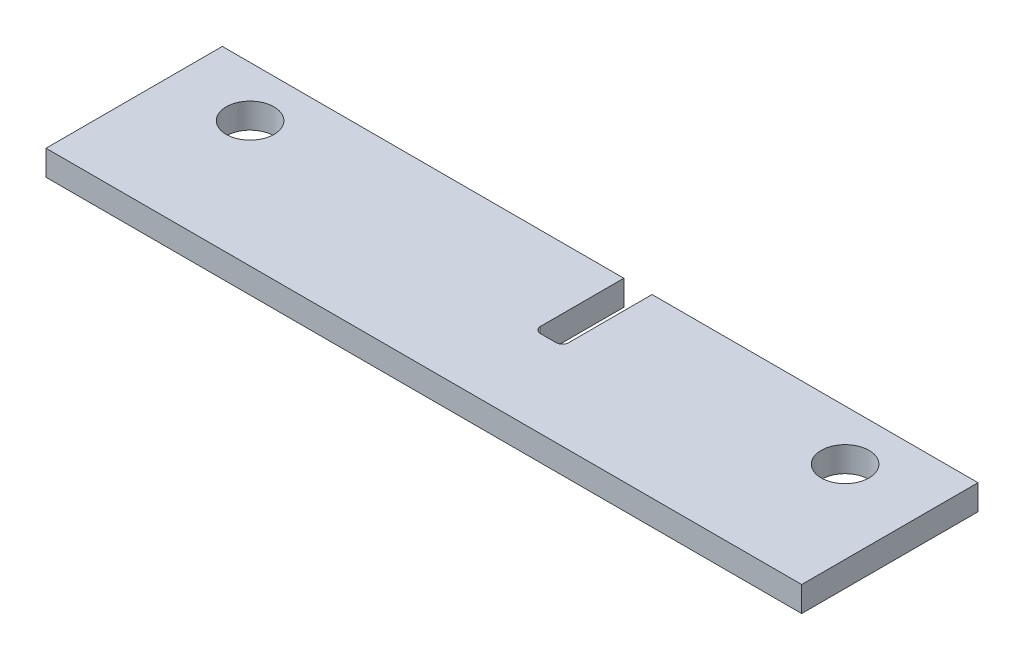
ISO-10303-21;
HEADER;
FILE_DESCRIPTION(('STEP AP214'),'2;1');
FILE_NAME('part.step','',(''),(''),'','','');
FILE_SCHEMA(('AUTOMOTIVE_DESIGN { 1 0 10303 214 1 1 1 1 }'));
ENDSEC;
DATA;
#1=APPLICATION_CONTEXT('core data for automotive mechanical design processes');
#2=APPLICATION_PROTOCOL_DEFINITION('international standard','automotive_design',2000,#1);
#3=PRODUCT_CONTEXT('',#1,'mechanical');
#4=PRODUCT('Part','Part','',(#3));
#5=PRODUCT_RELATED_PRODUCT_CATEGORY('part','',(#4));
#6=PRODUCT_DEFINITION_FORMATION('','',#4);
#7=PRODUCT_DEFINITION_CONTEXT('part definition',#1,'design');
#8=PRODUCT_DEFINITION('design','',#6,#7);
#9=PRODUCT_DEFINITION_SHAPE('','',#8);
#10=(LENGTH_UNIT() NAMED_UNIT(*) SI_UNIT(.MILLI.,.METRE.));
#11=(NAMED_UNIT(*) PLANE_ANGLE_UNIT() SI_UNIT($,.RADIAN.));
#12=(NAMED_UNIT(*) SI_UNIT($,.STERADIAN.) SOLID_ANGLE_UNIT());
#13=UNCERTAINTY_MEASURE_WITH_UNIT(LENGTH_MEASURE(1.E-05),#10,'distance_accuracy_value','');
#14=(GEOMETRIC_REPRESENTATION_CONTEXT(3) GLOBAL_UNCERTAINTY_ASSIGNED_CONTEXT((#13)) GLOBAL_UNIT_ASSIGNED_CONTEXT((#10,
#11,#12)) REPRESENTATION_CONTEXT('',''));
#15=CARTESIAN_POINT('',(0.,0.,0.));
#16=DIRECTION('',(0.,0.,1.));
#17=DIRECTION('',(1.,0.,0.));
#18=AXIS2_PLACEMENT_3D('',#15,#16,#17);
#19=CARTESIAN_POINT('',(0.,0.,249.6));
#20=DIRECTION('',(0.,0.,-1.));
#21=DIRECTION('',(-1.,0.,0.));
#22=AXIS2_PLACEMENT_3D('',#19,#20,#21);
#23=PLANE('',#22);
#24=DIRECTION('',(0.,1.,0.));
#25=VECTOR('',#24,1.);
#26=CARTESIAN_POINT('',(2477.262,115.8,249.6));
#27=LINE('',#26,#25);
#28=CARTESIAN_POINT('',(2477.262,115.8,249.6));
#29=VERTEX_POINT('',#28);
#30=CARTESIAN_POINT('',(2477.262,128.5,249.6));
#31=VERTEX_POINT('',#30);
#32=EDGE_CURVE('E148',#29,#31,#27,.T.);
#33=ORIENTED_EDGE('',*,*,#32,.T.);
#34=DIRECTION('',(-1.,0.,0.));
#35=VECTOR('',#34,1.);
#36=CARTESIAN_POINT('',(2260.6,128.5,249.6));
#37=LINE('',#36,#35);
#38=CARTESIAN_POINT('',(2641.6,128.5,249.6));
#39=VERTEX_POINT('',#38);
#40=EDGE_CURVE('E130',#39,#31,#37,.T.);
#41=ORIENTED_EDGE('',*,*,#40,.F.);
#42=DIRECTION('',(0.,1.,0.));
#43=VECTOR('',#42,1.);
#44=CARTESIAN_POINT('',(2641.6,115.8,249.6));
#45=LINE('',#44,#43);
#46=CARTESIAN_POINT('',(2641.6,115.8,249.6));
#47=VERTEX_POINT('',#46);
#48=EDGE_CURVE('E168',#47,#39,#45,.T.);
#49=ORIENTED_EDGE('',*,*,#48,.F.);
#50=DIRECTION('',(1.,0.,0.));
#51=VECTOR('',#50,1.);
#52=CARTESIAN_POINT('',(2260.6,115.8,249.6));
#53=LINE('',#52,#51);
#54=EDGE_CURVE('E186',#29,#47,#53,.T.);
#55=ORIENTED_EDGE('',*,*,#54,.F.);
#56=EDGE_LOOP('',(#33,#41,#49,#55));
#57=FACE_BOUND('',#56,.T.);
#58=ADVANCED_FACE('F43',(#57),#23,.T.);
#59=CARTESIAN_POINT('',(2260.6,115.8,249.6));
#60=DIRECTION('',(-1.,0.,0.));
#61=DIRECTION('',(0.,0.,1.));
#62=AXIS2_PLACEMENT_3D('',#59,#60,#61);
#63=PLANE('',#62);
#64=DIRECTION('',(0.,0.,1.));
#65=VECTOR('',#64,1.);
#66=CARTESIAN_POINT('',(2260.6,115.8,249.6));
#67=LINE('',#66,#65);
#68=CARTESIAN_POINT('',(2260.6,115.8,249.6));
#69=VERTEX_POINT('',#68);
#70=CARTESIAN_POINT('',(2260.6,115.8,338.5));
#71=VERTEX_POINT('',#70);
#72=EDGE_CURVE('E144',#69,#71,#67,.T.);
#73=ORIENTED_EDGE('',*,*,#72,.T.);
#74=DIRECTION('',(0.,-1.,0.));
#75=VECTOR('',#74,1.);
#76=CARTESIAN_POINT('',(2260.6,115.8,338.5));
#77=LINE('',#76,#75);
#78=CARTESIAN_POINT('',(2260.6,128.5,338.5));
#79=VERTEX_POINT('',#78);
#80=EDGE_CURVE('E137',#79,#71,#77,.T.);
#81=ORIENTED_EDGE('',*,*,#80,.F.);
#82=DIRECTION('',(0.,0.,1.));
#83=VECTOR('',#82,1.);
#84=CARTESIAN_POINT('',(2260.6,128.5,249.6));
#85=LINE('',#84,#83);
#86=CARTESIAN_POINT('',(2260.6,128.5,249.6));
#87=VERTEX_POINT('',#86);
#88=EDGE_CURVE('E122',#87,#79,#85,.T.);
#89=ORIENTED_EDGE('',*,*,#88,.F.);
#90=DIRECTION('',(0.,-1.,0.));
#91=VECTOR('',#90,1.);
#92=CARTESIAN_POINT('',(2260.6,115.8,249.6));
#93=LINE('',#92,#91);
#94=EDGE_CURVE('E135',#87,#69,#93,.T.);
#95=ORIENTED_EDGE('',*,*,#94,.T.);
#96=EDGE_LOOP('',(#73,#81,#89,#95));
#97=FACE_BOUND('',#96,.T.);
#98=ADVANCED_FACE('F134',(#97),#63,.T.);
#99=CARTESIAN_POINT('',(2260.6,128.5,249.6));
#100=DIRECTION('',(0.,1.,0.));
#101=DIRECTION('',(0.,0.,1.));
#102=AXIS2_PLACEMENT_3D('',#99,#100,#101);
#103=PLANE('',#102);
#104=CARTESIAN_POINT('',(2599.99999999996,128.5,275.));
#105=DIRECTION('',(0.,1.,0.));
#106=DIRECTION('',(0.,0.,1.));
#107=AXIS2_PLACEMENT_3D('',#104,#105,#106);
#108=CIRCLE('',#107,12.0649999999999);
#109=CARTESIAN_POINT('',(2599.99999999996,128.5,262.935));
#110=VERTEX_POINT('',#109);
#111=EDGE_CURVE('E143',#110,#110,#108,.F.);
#112=ORIENTED_EDGE('',*,*,#111,.T.);
#113=EDGE_LOOP('',(#112));
#114=FACE_BOUND('',#113,.T.);
#115=CARTESIAN_POINT('',(2299.99999999996,128.5,275.));
#116=DIRECTION('',(0.,1.,0.));
#117=DIRECTION('',(0.,0.,1.));
#118=AXIS2_PLACEMENT_3D('',#115,#116,#117);
#119=CIRCLE('',#118,12.0649999999999);
#120=CARTESIAN_POINT('',(2299.99999999996,128.5,262.935));
#121=VERTEX_POINT('',#120);
#122=EDGE_CURVE('E128',#121,#121,#119,.F.);
#123=ORIENTED_EDGE('',*,*,#122,.T.);
#124=EDGE_LOOP('',(#123));
#125=FACE_BOUND('',#124,.T.);
#126=DIRECTION('',(0.,0.,-1.));
#127=VECTOR('',#126,1.);
#128=CARTESIAN_POINT('',(2477.262,128.5,249.6));
#129=LINE('',#128,#127);
#130=CARTESIAN_POINT('',(2477.262,128.5,291.637));
#131=VERTEX_POINT('',#130);
#132=EDGE_CURVE('E155',#131,#31,#129,.T.);
#133=ORIENTED_EDGE('',*,*,#132,.F.);
#134=CARTESIAN_POINT('',(2474.087,128.5,291.637));
#135=DIRECTION('',(0.,1.,0.));
#136=DIRECTION('',(0.,0.,1.));
#137=AXIS2_PLACEMENT_3D('',#134,#135,#136);
#138=CIRCLE('',#137,3.175);
#139=CARTESIAN_POINT('',(2474.087,128.5,294.812));
#140=VERTEX_POINT('',#139);
#141=EDGE_CURVE('E198',#131,#140,#138,.F.);
#142=ORIENTED_EDGE('',*,*,#141,.T.);
#143=DIRECTION('',(1.,0.,0.));
#144=VECTOR('',#143,1.);
#145=CARTESIAN_POINT('',(2260.6,128.5,294.812000000001));
#146=LINE('',#145,#144);
#147=CARTESIAN_POINT('',(2466.213,128.5,294.812));
#148=VERTEX_POINT('',#147);
#149=EDGE_CURVE('E174',#148,#140,#146,.T.);
#150=ORIENTED_EDGE('',*,*,#149,.F.);
#151=CARTESIAN_POINT('',(2466.213,128.5,291.637));
#152=DIRECTION('',(0.,1.,0.));
#153=DIRECTION('',(0.,0.,1.));
#154=AXIS2_PLACEMENT_3D('',#151,#152,#153);
#155=CIRCLE('',#154,3.175);
#156=CARTESIAN_POINT('',(2463.038,128.5,291.637));
#157=VERTEX_POINT('',#156);
#158=EDGE_CURVE('E51',#148,#157,#155,.F.);
#159=ORIENTED_EDGE('',*,*,#158,.T.);
#160=DIRECTION('',(0.,0.,1.));
#161=VECTOR('',#160,1.);
#162=CARTESIAN_POINT('',(2463.038,128.5,249.6));
#163=LINE('',#162,#161);
#164=CARTESIAN_POINT('',(2463.038,128.5,249.6));
#165=VERTEX_POINT('',#164);
#166=EDGE_CURVE('E124',#165,#157,#163,.T.);
#167=ORIENTED_EDGE('',*,*,#166,.F.);
#168=EDGE_CURVE('E117',#165,#87,#37,.T.);
#169=ORIENTED_EDGE('',*,*,#168,.T.);
#170=ORIENTED_EDGE('',*,*,#88,.T.);
#171=DIRECTION('',(-1.,0.,0.));
#172=VECTOR('',#171,1.);
#173=CARTESIAN_POINT('',(2260.6,128.5,338.5));
#174=LINE('',#173,#172);
#175=CARTESIAN_POINT('',(2641.6,128.5,338.5));
#176=VERTEX_POINT('',#175);
#177=EDGE_CURVE('E153',#176,#79,#174,.T.);
#178=ORIENTED_EDGE('',*,*,#177,.F.);
#179=DIRECTION('',(0.,0.,1.));
#180=VECTOR('',#179,1.);
#181=CARTESIAN_POINT('',(2641.6,128.5,249.6));
#182=LINE('',#181,#180);
#183=EDGE_CURVE('E379',#39,#176,#182,.T.);
#184=ORIENTED_EDGE('',*,*,#183,.F.);
#185=ORIENTED_EDGE('',*,*,#40,.T.);
#186=EDGE_LOOP('',(#133,#142,#150,#159,#167,#169,#170,#178,#184,#185));
#187=FACE_BOUND('',#186,.T.);
#188=ADVANCED_FACE('F120',(#114,#125,#187),#103,.T.);
#189=CARTESIAN_POINT('',(2641.6,115.8,249.6));
#190=DIRECTION('',(1.,0.,0.));
#191=DIRECTION('',(0.,0.,-1.));
#192=AXIS2_PLACEMENT_3D('',#189,#190,#191);
#193=PLANE('',#192);
#194=ORIENTED_EDGE('',*,*,#183,.T.);
#195=DIRECTION('',(0.,1.,0.));
#196=VECTOR('',#195,1.);
#197=CARTESIAN_POINT('',(2641.6,115.8,338.5));
#198=LINE('',#197,#196);
#199=CARTESIAN_POINT('',(2641.6,115.8,338.5));
#200=VERTEX_POINT('',#199);
#201=EDGE_CURVE('E156',#200,#176,#198,.T.);
#202=ORIENTED_EDGE('',*,*,#201,.F.);
#203=DIRECTION('',(0.,0.,1.));
#204=VECTOR('',#203,1.);
#205=CARTESIAN_POINT('',(2641.6,115.8,249.6));
#206=LINE('',#205,#204);
#207=EDGE_CURVE('E385',#47,#200,#206,.T.);
#208=ORIENTED_EDGE('',*,*,#207,.F.);
#209=ORIENTED_EDGE('',*,*,#48,.T.);
#210=EDGE_LOOP('',(#194,#202,#208,#209));
#211=FACE_BOUND('',#210,.T.);
#212=ADVANCED_FACE('F249',(#211),#193,.T.);
#213=CARTESIAN_POINT('',(2260.6,115.8,249.6));
#214=DIRECTION('',(0.,-1.,0.));
#215=DIRECTION('',(0.,0.,-1.));
#216=AXIS2_PLACEMENT_3D('',#213,#214,#215);
#217=PLANE('',#216);
#218=CARTESIAN_POINT('',(2599.99999999996,115.8,275.));
#219=DIRECTION('',(0.,-1.,0.));
#220=DIRECTION('',(0.,0.,-1.));
#221=AXIS2_PLACEMENT_3D('',#218,#219,#220);
#222=CIRCLE('',#221,12.0649999999999);
#223=CARTESIAN_POINT('',(2599.99999999996,115.8,262.935));
#224=VERTEX_POINT('',#223);
#225=EDGE_CURVE('E164',#224,#224,#222,.F.);
#226=ORIENTED_EDGE('',*,*,#225,.T.);
#227=EDGE_LOOP('',(#226));
#228=FACE_BOUND('',#227,.T.);
#229=CARTESIAN_POINT('',(2299.99999999996,115.8,275.));
#230=DIRECTION('',(0.,-1.,0.));
#231=DIRECTION('',(0.,0.,-1.));
#232=AXIS2_PLACEMENT_3D('',#229,#230,#231);
#233=CIRCLE('',#232,12.0649999999999);
#234=CARTESIAN_POINT('',(2299.99999999996,115.8,262.935));
#235=VERTEX_POINT('',#234);
#236=EDGE_CURVE('E167',#235,#235,#233,.F.);
#237=ORIENTED_EDGE('',*,*,#236,.T.);
#238=EDGE_LOOP('',(#237));
#239=FACE_BOUND('',#238,.T.);
#240=DIRECTION('',(1.,0.,0.));
#241=VECTOR('',#240,1.);
#242=CARTESIAN_POINT('',(2476.5,115.8,294.812));
#243=LINE('',#242,#241);
#244=CARTESIAN_POINT('',(2466.213,115.8,294.812));
#245=VERTEX_POINT('',#244);
#246=CARTESIAN_POINT('',(2474.087,115.8,294.812));
#247=VERTEX_POINT('',#246);
#248=EDGE_CURVE('E162',#245,#247,#243,.T.);
#249=ORIENTED_EDGE('',*,*,#248,.T.);
#250=CARTESIAN_POINT('',(2474.087,115.8,291.637));
#251=DIRECTION('',(0.,-1.,0.));
#252=DIRECTION('',(0.,0.,-1.));
#253=AXIS2_PLACEMENT_3D('',#250,#251,#252);
#254=CIRCLE('',#253,3.175);
#255=CARTESIAN_POINT('',(2477.262,115.8,291.637));
#256=VERTEX_POINT('',#255);
#257=EDGE_CURVE('E200',#247,#256,#254,.F.);
#258=ORIENTED_EDGE('',*,*,#257,.T.);
#259=DIRECTION('',(0.,0.,-1.));
#260=VECTOR('',#259,1.);
#261=CARTESIAN_POINT('',(2477.262,115.8,249.6));
#262=LINE('',#261,#260);
#263=EDGE_CURVE('E173',#256,#29,#262,.T.);
#264=ORIENTED_EDGE('',*,*,#263,.T.);
#265=ORIENTED_EDGE('',*,*,#54,.T.);
#266=ORIENTED_EDGE('',*,*,#207,.T.);
#267=DIRECTION('',(1.,0.,0.));
#268=VECTOR('',#267,1.);
#269=CARTESIAN_POINT('',(2260.6,115.8,338.5));
#270=LINE('',#269,#268);
#271=EDGE_CURVE('E159',#71,#200,#270,.T.);
#272=ORIENTED_EDGE('',*,*,#271,.F.);
#273=ORIENTED_EDGE('',*,*,#72,.F.);
#274=CARTESIAN_POINT('',(2463.038,115.8,249.6));
#275=VERTEX_POINT('',#274);
#276=EDGE_CURVE('E142',#69,#275,#53,.T.);
#277=ORIENTED_EDGE('',*,*,#276,.T.);
#278=DIRECTION('',(0.,0.,1.));
#279=VECTOR('',#278,1.);
#280=CARTESIAN_POINT('',(2463.038,115.8,294.05));
#281=LINE('',#280,#279);
#282=CARTESIAN_POINT('',(2463.038,115.8,291.637));
#283=VERTEX_POINT('',#282);
#284=EDGE_CURVE('E181',#275,#283,#281,.T.);
#285=ORIENTED_EDGE('',*,*,#284,.T.);
#286=CARTESIAN_POINT('',(2466.213,115.8,291.637));
#287=DIRECTION('',(0.,-1.,0.));
#288=DIRECTION('',(0.,0.,-1.));
#289=AXIS2_PLACEMENT_3D('',#286,#287,#288);
#290=CIRCLE('',#289,3.175);
#291=EDGE_CURVE('E12',#283,#245,#290,.F.);
#292=ORIENTED_EDGE('',*,*,#291,.T.);
#293=EDGE_LOOP('',(#249,#258,#264,#265,#266,#272,#273,#277,#285,#292));
#294=FACE_BOUND('',#293,.T.);
#295=ADVANCED_FACE('F204',(#228,#239,#294),#217,.T.);
#296=DIRECTION('',(0.,1.,0.));
#297=VECTOR('',#296,1.);
#298=CARTESIAN_POINT('',(2463.038,0.,249.6));
#299=LINE('',#298,#297);
#300=EDGE_CURVE('E178',#275,#165,#299,.T.);
#301=ORIENTED_EDGE('',*,*,#300,.F.);
#302=ORIENTED_EDGE('',*,*,#276,.F.);
#303=ORIENTED_EDGE('',*,*,#94,.F.);
#304=ORIENTED_EDGE('',*,*,#168,.F.);
#305=EDGE_LOOP('',(#301,#302,#303,#304));
#306=FACE_BOUND('',#305,.T.);
#307=ADVANCED_FACE('F140',(#306),#23,.T.);
#308=CARTESIAN_POINT('',(0.,0.,338.5));
#309=DIRECTION('',(0.,0.,-1.));
#310=DIRECTION('',(-1.,0.,0.));
#311=AXIS2_PLACEMENT_3D('',#308,#309,#310);
#312=PLANE('',#311);
#313=ORIENTED_EDGE('',*,*,#80,.T.);
#314=ORIENTED_EDGE('',*,*,#271,.T.);
#315=ORIENTED_EDGE('',*,*,#201,.T.);
#316=ORIENTED_EDGE('',*,*,#177,.T.);
#317=EDGE_LOOP('',(#313,#314,#315,#316));
#318=FACE_BOUND('',#317,.T.);
#319=ADVANCED_FACE('F243',(#318),#312,.F.);
#320=CARTESIAN_POINT('',(2477.262,115.8,249.6));
#321=DIRECTION('',(1.,0.,0.));
#322=DIRECTION('',(0.,0.,-1.));
#323=AXIS2_PLACEMENT_3D('',#320,#321,#322);
#324=PLANE('',#323);
#325=ORIENTED_EDGE('',*,*,#263,.F.);
#326=DIRECTION('',(0.,1.,0.));
#327=VECTOR('',#326,1.);
#328=CARTESIAN_POINT('',(2477.262,128.5,291.637));
#329=LINE('',#328,#327);
#330=EDGE_CURVE('E180',#256,#131,#329,.T.);
#331=ORIENTED_EDGE('',*,*,#330,.T.);
#332=ORIENTED_EDGE('',*,*,#132,.T.);
#333=ORIENTED_EDGE('',*,*,#32,.F.);
#334=EDGE_LOOP('',(#325,#331,#332,#333));
#335=FACE_BOUND('',#334,.T.);
#336=ADVANCED_FACE('F211',(#335),#324,.F.);
#337=CARTESIAN_POINT('',(2476.5,115.8,294.812));
#338=DIRECTION('',(0.,0.,1.));
#339=DIRECTION('',(1.,0.,0.));
#340=AXIS2_PLACEMENT_3D('',#337,#338,#339);
#341=PLANE('',#340);
#342=ORIENTED_EDGE('',*,*,#149,.T.);
#343=DIRECTION('',(0.,1.,0.));
#344=VECTOR('',#343,1.);
#345=CARTESIAN_POINT('',(2474.087,115.8,294.812));
#346=LINE('',#345,#344);
#347=EDGE_CURVE('E195',#140,#247,#346,.F.);
#348=ORIENTED_EDGE('',*,*,#347,.T.);
#349=ORIENTED_EDGE('',*,*,#248,.F.);
#350=DIRECTION('',(0.,1.,0.));
#351=VECTOR('',#350,1.);
#352=CARTESIAN_POINT('',(2466.213,128.5,294.812));
#353=LINE('',#352,#351);
#354=EDGE_CURVE('E192',#245,#148,#353,.T.);
#355=ORIENTED_EDGE('',*,*,#354,.T.);
#356=EDGE_LOOP('',(#342,#348,#349,#355));
#357=FACE_BOUND('',#356,.T.);
#358=ADVANCED_FACE('F216',(#357),#341,.F.);
#359=CARTESIAN_POINT('',(2463.038,115.8,294.05));
#360=DIRECTION('',(-1.,0.,0.));
#361=DIRECTION('',(0.,0.,1.));
#362=AXIS2_PLACEMENT_3D('',#359,#360,#361);
#363=PLANE('',#362);
#364=ORIENTED_EDGE('',*,*,#166,.T.);
#365=DIRECTION('',(0.,1.,0.));
#366=VECTOR('',#365,1.);
#367=CARTESIAN_POINT('',(2463.038,115.8,291.637));
#368=LINE('',#367,#366);
#369=EDGE_CURVE('E58',#157,#283,#368,.F.);
#370=ORIENTED_EDGE('',*,*,#369,.T.);
#371=ORIENTED_EDGE('',*,*,#284,.F.);
#372=ORIENTED_EDGE('',*,*,#300,.T.);
#373=EDGE_LOOP('',(#364,#370,#371,#372));
#374=FACE_BOUND('',#373,.T.);
#375=ADVANCED_FACE('F220',(#374),#363,.F.);
#376=CARTESIAN_POINT('',(2299.99999999996,181.249999999996,275.));
#377=DIRECTION('',(0.,-1.,0.));
#378=DIRECTION('',(0.,0.,-1.));
#379=AXIS2_PLACEMENT_3D('',#376,#377,#378);
#380=CYLINDRICAL_SURFACE('',#379,12.0649999999999);
#381=CARTESIAN_POINT('',(2299.99999999996,128.5,262.935));
#382=CARTESIAN_POINT('',(2299.99999999996,128.367708333333,262.935));
#383=CARTESIAN_POINT('',(2299.99999999996,128.235416666667,262.935));
#384=CARTESIAN_POINT('',(2299.99999999996,127.970833333333,262.935));
#385=CARTESIAN_POINT('',(2299.99999999996,127.838541666667,262.935));
#386=CARTESIAN_POINT('',(2299.99999999996,127.573958333333,262.935));
#387=CARTESIAN_POINT('',(2299.99999999996,127.441666666667,262.935));
#388=CARTESIAN_POINT('',(2299.99999999996,127.177083333333,262.935));
#389=CARTESIAN_POINT('',(2299.99999999996,127.044791666667,262.935));
#390=CARTESIAN_POINT('',(2299.99999999996,126.780208333333,262.935));
#391=CARTESIAN_POINT('',(2299.99999999996,126.647916666667,262.935));
#392=CARTESIAN_POINT('',(2299.99999999996,126.383333333333,262.935));
#393=CARTESIAN_POINT('',(2299.99999999996,126.251041666667,262.935));
#394=CARTESIAN_POINT('',(2299.99999999996,125.986458333333,262.935));
#395=CARTESIAN_POINT('',(2299.99999999996,125.854166666667,262.935));
#396=CARTESIAN_POINT('',(2299.99999999996,125.589583333333,262.935));
#397=CARTESIAN_POINT('',(2299.99999999996,125.457291666667,262.935));
#398=CARTESIAN_POINT('',(2299.99999999996,125.192708333333,262.935));
#399=CARTESIAN_POINT('',(2299.99999999996,125.060416666667,262.935));
#400=CARTESIAN_POINT('',(2299.99999999996,124.795833333333,262.935));
#401=CARTESIAN_POINT('',(2299.99999999996,124.663541666667,262.935));
#402=CARTESIAN_POINT('',(2299.99999999996,124.398958333333,262.935));
#403=CARTESIAN_POINT('',(2299.99999999996,124.266666666667,262.935));
#404=CARTESIAN_POINT('',(2299.99999999996,124.002083333333,262.935));
#405=CARTESIAN_POINT('',(2299.99999999996,123.869791666667,262.935));
#406=CARTESIAN_POINT('',(2299.99999999996,123.605208333333,262.935));
#407=CARTESIAN_POINT('',(2299.99999999996,123.472916666667,262.935));
#408=CARTESIAN_POINT('',(2299.99999999996,123.208333333333,262.935));
#409=CARTESIAN_POINT('',(2299.99999999996,123.076041666667,262.935));
#410=CARTESIAN_POINT('',(2299.99999999996,122.811458333333,262.935));
#411=CARTESIAN_POINT('',(2299.99999999996,122.679166666667,262.935));
#412=CARTESIAN_POINT('',(2299.99999999996,122.414583333333,262.935));
#413=CARTESIAN_POINT('',(2299.99999999996,122.282291666667,262.935));
#414=CARTESIAN_POINT('',(2299.99999999996,122.017708333333,262.935));
#415=CARTESIAN_POINT('',(2299.99999999996,121.885416666667,262.935));
#416=CARTESIAN_POINT('',(2299.99999999996,121.620833333333,262.935));
#417=CARTESIAN_POINT('',(2299.99999999996,121.488541666667,262.935));
#418=CARTESIAN_POINT('',(2299.99999999996,121.223958333333,262.935));
#419=CARTESIAN_POINT('',(2299.99999999996,121.091666666667,262.935));
#420=CARTESIAN_POINT('',(2299.99999999996,120.827083333333,262.935));
#421=CARTESIAN_POINT('',(2299.99999999996,120.694791666667,262.935));
#422=CARTESIAN_POINT('',(2299.99999999996,120.430208333333,262.935));
#423=CARTESIAN_POINT('',(2299.99999999996,120.297916666667,262.935));
#424=CARTESIAN_POINT('',(2299.99999999996,120.033333333333,262.935));
#425=CARTESIAN_POINT('',(2299.99999999996,119.901041666667,262.935));
#426=CARTESIAN_POINT('',(2299.99999999996,119.636458333333,262.935));
#427=CARTESIAN_POINT('',(2299.99999999996,119.504166666667,262.935));
#428=CARTESIAN_POINT('',(2299.99999999996,119.239583333333,262.935));
#429=CARTESIAN_POINT('',(2299.99999999996,119.107291666667,262.935));
#430=CARTESIAN_POINT('',(2299.99999999996,118.842708333333,262.935));
#431=CARTESIAN_POINT('',(2299.99999999996,118.710416666667,262.935));
#432=CARTESIAN_POINT('',(2299.99999999996,118.445833333333,262.935));
#433=CARTESIAN_POINT('',(2299.99999999996,118.313541666667,262.935));
#434=CARTESIAN_POINT('',(2299.99999999996,118.048958333333,262.935));
#435=CARTESIAN_POINT('',(2299.99999999996,117.916666666667,262.935));
#436=CARTESIAN_POINT('',(2299.99999999996,117.652083333333,262.935));
#437=CARTESIAN_POINT('',(2299.99999999996,117.519791666667,262.935));
#438=CARTESIAN_POINT('',(2299.99999999996,117.255208333333,262.935));
#439=CARTESIAN_POINT('',(2299.99999999996,117.122916666667,262.935));
#440=CARTESIAN_POINT('',(2299.99999999996,116.858333333333,262.935));
#441=CARTESIAN_POINT('',(2299.99999999996,116.726041666667,262.935));
#442=CARTESIAN_POINT('',(2299.99999999996,116.461458333333,262.935));
#443=CARTESIAN_POINT('',(2299.99999999996,116.329166666667,262.935));
#444=CARTESIAN_POINT('',(2299.99999999996,116.064583333333,262.935));
#445=CARTESIAN_POINT('',(2299.99999999996,115.932291666667,262.935));
#446=CARTESIAN_POINT('',(2299.99999999996,115.8,262.935));
#447=B_SPLINE_CURVE_WITH_KNOTS('',3,(#381,#382,#383,#384,#385,#386,#387,#388,#389,#390,#391,
#392,#393,#394,#395,#396,#397,#398,#399,#400,#401,#402,#403,#404,#405,#406,#407,#408,#409,#410,
#411,#412,#413,#414,#415,#416,#417,#418,#419,#420,#421,#422,#423,#424,#425,#426,#427,#428,#429,
#430,#431,#432,#433,#434,#435,#436,#437,#438,#439,#440,#441,#442,#443,#444,#445,#446),
.UNSPECIFIED.,.F.,.F.,(4,2,2,2,2,2,2,2,2,2,2,2,2,2,2,2,2,2,2,2,2,2,2,2,2,2,2,2,2,2,2,2,4),(0.,
0.396874999999991,0.793749999999982,1.190625,1.58749999999999,1.98437499999998,2.38124999999997,
2.77812499999996,3.17499999999998,3.57187499999997,3.96874999999998,4.36562499999998,
4.76249999999998,5.15937499999998,5.55624999999998,5.95312499999998,6.34999999999997,
6.74687499999997,7.14374999999998,7.54062499999997,7.93749999999997,8.33437499999998,
8.73124999999997,9.12812499999996,9.52499999999996,9.92187499999997,10.31875,10.715625,11.1125,
11.509375,11.90625,12.303125,12.7),.UNSPECIFIED.);
#448=EDGE_CURVE('BSEAM222',#121,#235,#447,.T.);
#449=ORIENTED_EDGE('',*,*,#122,.F.);
#450=ORIENTED_EDGE('',*,*,#236,.F.);
#451=ORIENTED_EDGE('',*,*,#448,.T.);
#452=ORIENTED_EDGE('',*,*,#448,.F.);
#453=EDGE_LOOP('',(#449,#451,#450,#452));
#454=FACE_BOUND('',#453,.T.);
#455=ADVANCED_FACE('F222',(#454),#380,.F.);
#456=CARTESIAN_POINT('',(2599.99999999996,289.999999999996,275.));
#457=DIRECTION('',(0.,-1.,0.));
#458=DIRECTION('',(0.,0.,-1.));
#459=AXIS2_PLACEMENT_3D('',#456,#457,#458);
#460=CYLINDRICAL_SURFACE('',#459,12.0649999999999);
#461=CARTESIAN_POINT('',(2599.99999999996,128.5,262.935));
#462=CARTESIAN_POINT('',(2599.99999999996,128.367708333333,262.935));
#463=CARTESIAN_POINT('',(2599.99999999996,128.235416666667,262.935));
#464=CARTESIAN_POINT('',(2599.99999999996,127.970833333333,262.935));
#465=CARTESIAN_POINT('',(2599.99999999996,127.838541666667,262.935));
#466=CARTESIAN_POINT('',(2599.99999999996,127.573958333333,262.935));
#467=CARTESIAN_POINT('',(2599.99999999996,127.441666666667,262.935));
#468=CARTESIAN_POINT('',(2599.99999999996,127.177083333333,262.935));
#469=CARTESIAN_POINT('',(2599.99999999996,127.044791666667,262.935));
#470=CARTESIAN_POINT('',(2599.99999999996,126.780208333333,262.935));
#471=CARTESIAN_POINT('',(2599.99999999996,126.647916666667,262.935));
#472=CARTESIAN_POINT('',(2599.99999999996,126.383333333333,262.935));
#473=CARTESIAN_POINT('',(2599.99999999996,126.251041666667,262.935));
#474=CARTESIAN_POINT('',(2599.99999999996,125.986458333333,262.935));
#475=CARTESIAN_POINT('',(2599.99999999996,125.854166666667,262.935));
#476=CARTESIAN_POINT('',(2599.99999999996,125.589583333333,262.935));
#477=CARTESIAN_POINT('',(2599.99999999996,125.457291666667,262.935));
#478=CARTESIAN_POINT('',(2599.99999999996,125.192708333333,262.935));
#479=CARTESIAN_POINT('',(2599.99999999996,125.060416666667,262.935));
#480=CARTESIAN_POINT('',(2599.99999999996,124.795833333333,262.935));
#481=CARTESIAN_POINT('',(2599.99999999996,124.663541666667,262.935));
#482=CARTESIAN_POINT('',(2599.99999999996,124.398958333333,262.935));
#483=CARTESIAN_POINT('',(2599.99999999996,124.266666666667,262.935));
#484=CARTESIAN_POINT('',(2599.99999999996,124.002083333333,262.935));
#485=CARTESIAN_POINT('',(2599.99999999996,123.869791666667,262.935));
#486=CARTESIAN_POINT('',(2599.99999999996,123.605208333333,262.935));
#487=CARTESIAN_POINT('',(2599.99999999996,123.472916666667,262.935));
#488=CARTESIAN_POINT('',(2599.99999999996,123.208333333333,262.935));
#489=CARTESIAN_POINT('',(2599.99999999996,123.076041666667,262.935));
#490=CARTESIAN_POINT('',(2599.99999999996,122.811458333333,262.935));
#491=CARTESIAN_POINT('',(2599.99999999996,122.679166666667,262.935));
#492=CARTESIAN_POINT('',(2599.99999999996,122.414583333333,262.935));
#493=CARTESIAN_POINT('',(2599.99999999996,122.282291666667,262.935));
#494=CARTESIAN_POINT('',(2599.99999999996,122.017708333333,262.935));
#495=CARTESIAN_POINT('',(2599.99999999996,121.885416666667,262.935));
#496=CARTESIAN_POINT('',(2599.99999999996,121.620833333333,262.935));
#497=CARTESIAN_POINT('',(2599.99999999996,121.488541666667,262.935));
#498=CARTESIAN_POINT('',(2599.99999999996,121.223958333333,262.935));
#499=CARTESIAN_POINT('',(2599.99999999996,121.091666666667,262.935));
#500=CARTESIAN_POINT('',(2599.99999999996,120.827083333333,262.935));
#501=CARTESIAN_POINT('',(2599.99999999996,120.694791666667,262.935));
#502=CARTESIAN_POINT('',(2599.99999999996,120.430208333333,262.935));
#503=CARTESIAN_POINT('',(2599.99999999996,120.297916666667,262.935));
#504=CARTESIAN_POINT('',(2599.99999999996,120.033333333333,262.935));
#505=CARTESIAN_POINT('',(2599.99999999996,119.901041666667,262.935));
#506=CARTESIAN_POINT('',(2599.99999999996,119.636458333333,262.935));
#507=CARTESIAN_POINT('',(2599.99999999996,119.504166666667,262.935));
#508=CARTESIAN_POINT('',(2599.99999999996,119.239583333333,262.935));
#509=CARTESIAN_POINT('',(2599.99999999996,119.107291666667,262.935));
#510=CARTESIAN_POINT('',(2599.99999999996,118.842708333333,262.935));
#511=CARTESIAN_POINT('',(2599.99999999996,118.710416666667,262.935));
#512=CARTESIAN_POINT('',(2599.99999999996,118.445833333333,262.935));
#513=CARTESIAN_POINT('',(2599.99999999996,118.313541666667,262.935));
#514=CARTESIAN_POINT('',(2599.99999999996,118.048958333333,262.935));
#515=CARTESIAN_POINT('',(2599.99999999996,117.916666666667,262.935));
#516=CARTESIAN_POINT('',(2599.99999999996,117.652083333333,262.935));
#517=CARTESIAN_POINT('',(2599.99999999996,117.519791666667,262.935));
#518=CARTESIAN_POINT('',(2599.99999999996,117.255208333333,262.935));
#519=CARTESIAN_POINT('',(2599.99999999996,117.122916666667,262.935));
#520=CARTESIAN_POINT('',(2599.99999999996,116.858333333333,262.935));
#521=CARTESIAN_POINT('',(2599.99999999996,116.726041666667,262.935));
#522=CARTESIAN_POINT('',(2599.99999999996,116.461458333333,262.935));
#523=CARTESIAN_POINT('',(2599.99999999996,116.329166666667,262.935));
#524=CARTESIAN_POINT('',(2599.99999999996,116.064583333333,262.935));
#525=CARTESIAN_POINT('',(2599.99999999996,115.932291666667,262.935));
#526=CARTESIAN_POINT('',(2599.99999999996,115.8,262.935));
#527=B_SPLINE_CURVE_WITH_KNOTS('',3,(#461,#462,#463,#464,#465,#466,#467,#468,#469,#470,#471,
#472,#473,#474,#475,#476,#477,#478,#479,#480,#481,#482,#483,#484,#485,#486,#487,#488,#489,#490,
#491,#492,#493,#494,#495,#496,#497,#498,#499,#500,#501,#502,#503,#504,#505,#506,#507,#508,#509,
#510,#511,#512,#513,#514,#515,#516,#517,#518,#519,#520,#521,#522,#523,#524,#525,#526),
.UNSPECIFIED.,.F.,.F.,(4,2,2,2,2,2,2,2,2,2,2,2,2,2,2,2,2,2,2,2,2,2,2,2,2,2,2,2,2,2,2,2,4),(0.,
0.396874999999991,0.79375000000001,1.190625,1.58749999999999,1.98437500000001,2.38125,
2.77812499999999,3.17499999999998,3.571875,3.96874999999999,4.36562499999998,4.7625,
5.15937499999999,5.55624999999998,5.953125,6.34999999999999,6.74687499999999,7.14375,7.540625,
7.93749999999999,8.334375,8.73125,9.12812499999999,9.52500000000001,9.921875,10.31875,10.715625,
11.1125,11.509375,11.90625,12.303125,12.7),.UNSPECIFIED.);
#528=EDGE_CURVE('BSEAM228',#110,#224,#527,.T.);
#529=ORIENTED_EDGE('',*,*,#111,.F.);
#530=ORIENTED_EDGE('',*,*,#225,.F.);
#531=ORIENTED_EDGE('',*,*,#528,.T.);
#532=ORIENTED_EDGE('',*,*,#528,.F.);
#533=EDGE_LOOP('',(#529,#531,#530,#532));
#534=FACE_BOUND('',#533,.T.);
#535=ADVANCED_FACE('F228',(#534),#460,.F.);
#536=CARTESIAN_POINT('',(2474.087,115.8,291.637));
#537=DIRECTION('',(0.,-1.,0.));
#538=DIRECTION('',(0.,0.,-1.));
#539=AXIS2_PLACEMENT_3D('',#536,#537,#538);
#540=CYLINDRICAL_SURFACE('',#539,3.175);
#541=ORIENTED_EDGE('',*,*,#257,.F.);
#542=ORIENTED_EDGE('',*,*,#347,.F.);
#543=ORIENTED_EDGE('',*,*,#141,.F.);
#544=ORIENTED_EDGE('',*,*,#330,.F.);
#545=EDGE_LOOP('',(#541,#542,#543,#544));
#546=FACE_BOUND('',#545,.T.);
#547=ADVANCED_FACE('F213',(#546),#540,.F.);
#548=CARTESIAN_POINT('',(2466.213,115.8,291.637));
#549=DIRECTION('',(0.,-1.,0.));
#550=DIRECTION('',(0.,0.,-1.));
#551=AXIS2_PLACEMENT_3D('',#548,#549,#550);
#552=CYLINDRICAL_SURFACE('',#551,3.175);
#553=ORIENTED_EDGE('',*,*,#291,.F.);
#554=ORIENTED_EDGE('',*,*,#369,.F.);
#555=ORIENTED_EDGE('',*,*,#158,.F.);
#556=ORIENTED_EDGE('',*,*,#354,.F.);
#557=EDGE_LOOP('',(#553,#554,#555,#556));
#558=FACE_BOUND('',#557,.T.);
#559=ADVANCED_FACE('F45',(#558),#552,.F.);
#560=CLOSED_SHELL('',(#58,#98,#188,#212,#295,#307,#319,#336,#358,#375,#455,#535,#547,#559));
#561=MANIFOLD_SOLID_BREP('B2',#560);
#562=ADVANCED_BREP_SHAPE_REPRESENTATION('',(#18,#561),#14);
#563=SHAPE_DEFINITION_REPRESENTATION(#9,#562);
ENDSEC;
END-ISO-10303-21;
